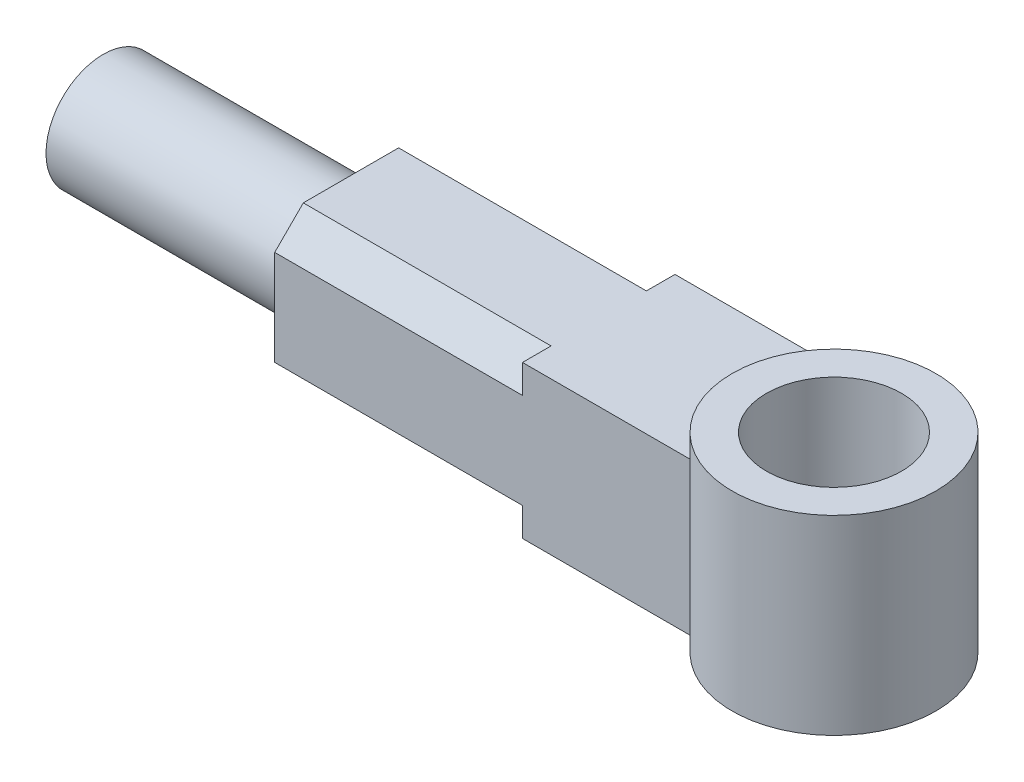
ISO-10303-21;
HEADER;
FILE_DESCRIPTION(('STEP AP214'),'2;1');
FILE_NAME('part.step','',(''),(''),'','','');
FILE_SCHEMA(('AUTOMOTIVE_DESIGN { 1 0 10303 214 1 1 1 1 }'));
ENDSEC;
DATA;
#1=APPLICATION_CONTEXT('core data for automotive mechanical design processes');
#2=APPLICATION_PROTOCOL_DEFINITION('international standard','automotive_design',2000,#1);
#3=PRODUCT_CONTEXT('',#1,'mechanical');
#4=PRODUCT('Part','Part','',(#3));
#5=PRODUCT_RELATED_PRODUCT_CATEGORY('part','',(#4));
#6=PRODUCT_DEFINITION_FORMATION('','',#4);
#7=PRODUCT_DEFINITION_CONTEXT('part definition',#1,'design');
#8=PRODUCT_DEFINITION('design','',#6,#7);
#9=PRODUCT_DEFINITION_SHAPE('','',#8);
#10=(LENGTH_UNIT() NAMED_UNIT(*) SI_UNIT(.MILLI.,.METRE.));
#11=(NAMED_UNIT(*) PLANE_ANGLE_UNIT() SI_UNIT($,.RADIAN.));
#12=(NAMED_UNIT(*) SI_UNIT($,.STERADIAN.) SOLID_ANGLE_UNIT());
#13=UNCERTAINTY_MEASURE_WITH_UNIT(LENGTH_MEASURE(1.E-05),#10,'distance_accuracy_value','');
#14=(GEOMETRIC_REPRESENTATION_CONTEXT(3) GLOBAL_UNCERTAINTY_ASSIGNED_CONTEXT((#13)) GLOBAL_UNIT_ASSIGNED_CONTEXT((#10,
#11,#12)) REPRESENTATION_CONTEXT('',''));
#15=CARTESIAN_POINT('',(0.,0.,0.));
#16=DIRECTION('',(0.,0.,1.));
#17=DIRECTION('',(1.,0.,0.));
#18=AXIS2_PLACEMENT_3D('',#15,#16,#17);
#19=CARTESIAN_POINT('',(-140.311288741493,0.,20.));
#20=DIRECTION('',(1.,0.,0.));
#21=DIRECTION('',(0.,0.,-1.));
#22=AXIS2_PLACEMENT_3D('',#19,#20,#21);
#23=PLANE('',#22);
#24=DIRECTION('',(0.,-1.,0.));
#25=VECTOR('',#24,1.);
#26=CARTESIAN_POINT('',(-140.311288741493,0.,-20.));
#27=LINE('',#26,#25);
#28=CARTESIAN_POINT('',(-140.311288741493,12.5,-20.));
#29=VERTEX_POINT('',#28);
#30=CARTESIAN_POINT('',(-140.311288741493,-12.4999999999998,-20.0000000000002));
#31=VERTEX_POINT('',#30);
#32=EDGE_CURVE('E160',#29,#31,#27,.T.);
#33=ORIENTED_EDGE('',*,*,#32,.T.);
#34=DIRECTION('',(0.,0.707106781186552,-0.707106781186543));
#35=VECTOR('',#34,1.);
#36=CARTESIAN_POINT('',(-140.311288741493,-12.4999999999998,-20.0000000000002));
#37=LINE('',#36,#35);
#38=CARTESIAN_POINT('',(-140.311288741493,-19.9999999999999,-12.5000000000002));
#39=VERTEX_POINT('',#38);
#40=EDGE_CURVE('E178',#39,#31,#37,.T.);
#41=ORIENTED_EDGE('',*,*,#40,.F.);
#42=DIRECTION('',(0.,0.,-1.));
#43=VECTOR('',#42,1.);
#44=CARTESIAN_POINT('',(-140.311288741493,-20.,20.));
#45=LINE('',#44,#43);
#46=CARTESIAN_POINT('',(-140.311288741493,-20.,12.5));
#47=VERTEX_POINT('',#46);
#48=EDGE_CURVE('E170',#47,#39,#45,.T.);
#49=ORIENTED_EDGE('',*,*,#48,.F.);
#50=DIRECTION('',(0.,-0.70710678118655,-0.707106781186545));
#51=VECTOR('',#50,1.);
#52=CARTESIAN_POINT('',(-140.311288741493,-20.,12.5));
#53=LINE('',#52,#51);
#54=CARTESIAN_POINT('',(-140.311288741493,-12.5,20.));
#55=VERTEX_POINT('',#54);
#56=EDGE_CURVE('E192',#55,#47,#53,.T.);
#57=ORIENTED_EDGE('',*,*,#56,.F.);
#58=DIRECTION('',(0.,-1.,0.));
#59=VECTOR('',#58,1.);
#60=CARTESIAN_POINT('',(-140.311288741493,0.,20.));
#61=LINE('',#60,#59);
#62=CARTESIAN_POINT('',(-140.311288741493,12.5,20.));
#63=VERTEX_POINT('',#62);
#64=EDGE_CURVE('E174',#63,#55,#61,.T.);
#65=ORIENTED_EDGE('',*,*,#64,.F.);
#66=DIRECTION('',(0.,-0.707106781186547,0.707106781186548));
#67=VECTOR('',#66,1.);
#68=CARTESIAN_POINT('',(-140.311288741493,12.5,20.));
#69=LINE('',#68,#67);
#70=CARTESIAN_POINT('',(-140.311288741493,20.,12.5));
#71=VERTEX_POINT('',#70);
#72=EDGE_CURVE('E207',#71,#63,#69,.T.);
#73=ORIENTED_EDGE('',*,*,#72,.F.);
#74=DIRECTION('',(0.,0.,-1.));
#75=VECTOR('',#74,1.);
#76=CARTESIAN_POINT('',(-140.311288741493,20.,20.));
#77=LINE('',#76,#75);
#78=CARTESIAN_POINT('',(-140.311288741493,20.,-12.5));
#79=VERTEX_POINT('',#78);
#80=EDGE_CURVE('E173',#71,#79,#77,.T.);
#81=ORIENTED_EDGE('',*,*,#80,.T.);
#82=DIRECTION('',(0.,0.70710678118655,0.707106781186545));
#83=VECTOR('',#82,1.);
#84=CARTESIAN_POINT('',(-140.311288741493,20.,-12.5));
#85=LINE('',#84,#83);
#86=EDGE_CURVE('E225',#29,#79,#85,.T.);
#87=ORIENTED_EDGE('',*,*,#86,.F.);
#88=EDGE_LOOP('',(#33,#41,#49,#57,#65,#73,#81,#87));
#89=FACE_BOUND('',#88,.T.);
#90=CARTESIAN_POINT('',(-140.311288741493,0.,0.));
#91=DIRECTION('',(1.,0.,0.));
#92=DIRECTION('',(0.,0.,-1.));
#93=AXIS2_PLACEMENT_3D('',#90,#91,#92);
#94=CIRCLE('',#93,15.);
#95=CARTESIAN_POINT('',(-140.311288741493,0.,-15.));
#96=VERTEX_POINT('',#95);
#97=EDGE_CURVE('E60',#96,#96,#94,.F.);
#98=ORIENTED_EDGE('',*,*,#97,.F.);
#99=EDGE_LOOP('',(#98));
#100=FACE_BOUND('',#99,.T.);
#101=ADVANCED_FACE('F51',(#89,#100),#23,.F.);
#102=CARTESIAN_POINT('',(0.,-20.,20.));
#103=DIRECTION('',(0.,-1.,0.));
#104=DIRECTION('',(1.,0.,0.));
#105=AXIS2_PLACEMENT_3D('',#102,#103,#104);
#106=PLANE('',#105);
#107=CARTESIAN_POINT('',(-13.5890665192705,-20.,0.));
#108=DIRECTION('',(0.,-1.,0.));
#109=DIRECTION('',(1.,0.,0.));
#110=AXIS2_PLACEMENT_3D('',#107,#108,#109);
#111=CIRCLE('',#110,26.7222222222222);
#112=CARTESIAN_POINT('',(-31.3112887414927,-20.,20.));
#113=VERTEX_POINT('',#112);
#114=CARTESIAN_POINT('',(-31.3112887414927,-20.,-20.));
#115=VERTEX_POINT('',#114);
#116=EDGE_CURVE('E139',#113,#115,#111,.T.);
#117=ORIENTED_EDGE('',*,*,#116,.F.);
#118=DIRECTION('',(-1.,0.,0.));
#119=VECTOR('',#118,1.);
#120=CARTESIAN_POINT('',(0.,-20.,20.));
#121=LINE('',#120,#119);
#122=CARTESIAN_POINT('',(-75.3112887414927,-20.,20.));
#123=VERTEX_POINT('',#122);
#124=EDGE_CURVE('E164',#113,#123,#121,.T.);
#125=ORIENTED_EDGE('',*,*,#124,.T.);
#126=DIRECTION('',(0.,0.,1.));
#127=VECTOR('',#126,1.);
#128=CARTESIAN_POINT('',(-75.3112887414927,-20.,12.5));
#129=LINE('',#128,#127);
#130=CARTESIAN_POINT('',(-75.3112887414927,-20.,12.5));
#131=VERTEX_POINT('',#130);
#132=EDGE_CURVE('E200',#131,#123,#129,.T.);
#133=ORIENTED_EDGE('',*,*,#132,.F.);
#134=DIRECTION('',(-1.,0.,0.));
#135=VECTOR('',#134,1.);
#136=CARTESIAN_POINT('',(-75.3112887414927,-20.,12.5));
#137=LINE('',#136,#135);
#138=EDGE_CURVE('E204',#131,#47,#137,.T.);
#139=ORIENTED_EDGE('',*,*,#138,.T.);
#140=ORIENTED_EDGE('',*,*,#48,.T.);
#141=DIRECTION('',(-1.,0.,0.));
#142=VECTOR('',#141,1.);
#143=CARTESIAN_POINT('',(-75.3112887414927,-19.9999999999999,-12.5000000000002));
#144=LINE('',#143,#142);
#145=CARTESIAN_POINT('',(-75.3112887414927,-19.9999999999999,-12.5000000000002));
#146=VERTEX_POINT('',#145);
#147=EDGE_CURVE('E187',#146,#39,#144,.T.);
#148=ORIENTED_EDGE('',*,*,#147,.F.);
#149=DIRECTION('',(0.,0.,1.));
#150=VECTOR('',#149,1.);
#151=CARTESIAN_POINT('',(-75.3112887414927,-19.9999999999998,-20.0000000000002));
#152=LINE('',#151,#150);
#153=CARTESIAN_POINT('',(-75.3112887414927,-19.9999999999998,-20.0000000000002));
#154=VERTEX_POINT('',#153);
#155=EDGE_CURVE('E179',#154,#146,#152,.T.);
#156=ORIENTED_EDGE('',*,*,#155,.F.);
#157=DIRECTION('',(-1.,0.,0.));
#158=VECTOR('',#157,1.);
#159=CARTESIAN_POINT('',(0.,-20.,-20.));
#160=LINE('',#159,#158);
#161=EDGE_CURVE('E161',#115,#154,#160,.T.);
#162=ORIENTED_EDGE('',*,*,#161,.F.);
#163=EDGE_LOOP('',(#117,#125,#133,#139,#140,#148,#156,#162));
#164=FACE_BOUND('',#163,.T.);
#165=ADVANCED_FACE('F53',(#164),#106,.T.);
#166=CARTESIAN_POINT('',(0.,20.,20.));
#167=DIRECTION('',(0.,-1.,0.));
#168=DIRECTION('',(1.,0.,0.));
#169=AXIS2_PLACEMENT_3D('',#166,#167,#168);
#170=PLANE('',#169);
#171=DIRECTION('',(-1.,0.,0.));
#172=VECTOR('',#171,1.);
#173=CARTESIAN_POINT('',(0.,20.,20.));
#174=LINE('',#173,#172);
#175=CARTESIAN_POINT('',(-31.3112887414927,20.,20.));
#176=VERTEX_POINT('',#175);
#177=CARTESIAN_POINT('',(-75.3112887414927,19.9999999999999,20.));
#178=VERTEX_POINT('',#177);
#179=EDGE_CURVE('E152',#176,#178,#174,.T.);
#180=ORIENTED_EDGE('',*,*,#179,.F.);
#181=CARTESIAN_POINT('',(-13.5890665192705,20.,0.));
#182=DIRECTION('',(0.,-1.,0.));
#183=DIRECTION('',(1.,0.,0.));
#184=AXIS2_PLACEMENT_3D('',#181,#182,#183);
#185=CIRCLE('',#184,26.7222222222222);
#186=CARTESIAN_POINT('',(-31.3112887414927,20.,-20.));
#187=VERTEX_POINT('',#186);
#188=EDGE_CURVE('E136',#176,#187,#185,.T.);
#189=ORIENTED_EDGE('',*,*,#188,.T.);
#190=DIRECTION('',(-1.,0.,0.));
#191=VECTOR('',#190,1.);
#192=CARTESIAN_POINT('',(0.,20.,-20.));
#193=LINE('',#192,#191);
#194=CARTESIAN_POINT('',(-75.3112887414927,20.,-20.));
#195=VERTEX_POINT('',#194);
#196=EDGE_CURVE('E149',#187,#195,#193,.T.);
#197=ORIENTED_EDGE('',*,*,#196,.T.);
#198=DIRECTION('',(0.,0.,-1.));
#199=VECTOR('',#198,1.);
#200=CARTESIAN_POINT('',(-75.3112887414927,20.,-12.5));
#201=LINE('',#200,#199);
#202=CARTESIAN_POINT('',(-75.3112887414927,20.,-12.5));
#203=VERTEX_POINT('',#202);
#204=EDGE_CURVE('E230',#203,#195,#201,.T.);
#205=ORIENTED_EDGE('',*,*,#204,.F.);
#206=DIRECTION('',(-1.,0.,0.));
#207=VECTOR('',#206,1.);
#208=CARTESIAN_POINT('',(-75.3112887414927,20.,-12.5));
#209=LINE('',#208,#207);
#210=EDGE_CURVE('E166',#203,#79,#209,.T.);
#211=ORIENTED_EDGE('',*,*,#210,.T.);
#212=ORIENTED_EDGE('',*,*,#80,.F.);
#213=DIRECTION('',(-1.,0.,0.));
#214=VECTOR('',#213,1.);
#215=CARTESIAN_POINT('',(-75.3112887414927,20.,12.5));
#216=LINE('',#215,#214);
#217=CARTESIAN_POINT('',(-75.3112887414927,20.,12.5));
#218=VERTEX_POINT('',#217);
#219=EDGE_CURVE('E216',#218,#71,#216,.T.);
#220=ORIENTED_EDGE('',*,*,#219,.F.);
#221=DIRECTION('',(0.,0.,-1.));
#222=VECTOR('',#221,1.);
#223=CARTESIAN_POINT('',(-75.3112887414927,19.9999999999999,20.));
#224=LINE('',#223,#222);
#225=EDGE_CURVE('E209',#178,#218,#224,.T.);
#226=ORIENTED_EDGE('',*,*,#225,.F.);
#227=EDGE_LOOP('',(#180,#189,#197,#205,#211,#212,#220,#226));
#228=FACE_BOUND('',#227,.T.);
#229=ADVANCED_FACE('F147',(#228),#170,.F.);
#230=CARTESIAN_POINT('',(0.,0.,20.));
#231=DIRECTION('',(0.,0.,1.));
#232=DIRECTION('',(1.,0.,0.));
#233=AXIS2_PLACEMENT_3D('',#230,#231,#232);
#234=PLANE('',#233);
#235=DIRECTION('',(0.,-1.,0.));
#236=VECTOR('',#235,1.);
#237=CARTESIAN_POINT('',(-31.3112887414927,0.,20.));
#238=LINE('',#237,#236);
#239=EDGE_CURVE('E177',#176,#113,#238,.T.);
#240=ORIENTED_EDGE('',*,*,#239,.F.);
#241=ORIENTED_EDGE('',*,*,#179,.T.);
#242=DIRECTION('',(0.,1.,0.));
#243=VECTOR('',#242,1.);
#244=CARTESIAN_POINT('',(-75.3112887414927,12.5,20.));
#245=LINE('',#244,#243);
#246=CARTESIAN_POINT('',(-75.3112887414927,12.5,20.));
#247=VERTEX_POINT('',#246);
#248=EDGE_CURVE('E214',#247,#178,#245,.T.);
#249=ORIENTED_EDGE('',*,*,#248,.F.);
#250=DIRECTION('',(-1.,0.,0.));
#251=VECTOR('',#250,1.);
#252=CARTESIAN_POINT('',(-75.3112887414927,12.5,20.));
#253=LINE('',#252,#251);
#254=EDGE_CURVE('E218',#247,#63,#253,.T.);
#255=ORIENTED_EDGE('',*,*,#254,.T.);
#256=ORIENTED_EDGE('',*,*,#64,.T.);
#257=DIRECTION('',(-1.,0.,0.));
#258=VECTOR('',#257,1.);
#259=CARTESIAN_POINT('',(-75.3112887414927,-12.5,20.));
#260=LINE('',#259,#258);
#261=CARTESIAN_POINT('',(-75.3112887414927,-12.5,20.));
#262=VERTEX_POINT('',#261);
#263=EDGE_CURVE('E202',#262,#55,#260,.T.);
#264=ORIENTED_EDGE('',*,*,#263,.F.);
#265=DIRECTION('',(0.,1.,0.));
#266=VECTOR('',#265,1.);
#267=CARTESIAN_POINT('',(-75.3112887414927,-20.,20.));
#268=LINE('',#267,#266);
#269=EDGE_CURVE('E194',#123,#262,#268,.T.);
#270=ORIENTED_EDGE('',*,*,#269,.F.);
#271=ORIENTED_EDGE('',*,*,#124,.F.);
#272=EDGE_LOOP('',(#240,#241,#249,#255,#256,#264,#270,#271));
#273=FACE_BOUND('',#272,.T.);
#274=ADVANCED_FACE('F244',(#273),#234,.T.);
#275=CARTESIAN_POINT('',(0.,0.,-20.));
#276=DIRECTION('',(0.,0.,1.));
#277=DIRECTION('',(1.,0.,0.));
#278=AXIS2_PLACEMENT_3D('',#275,#276,#277);
#279=PLANE('',#278);
#280=ORIENTED_EDGE('',*,*,#196,.F.);
#281=DIRECTION('',(0.,-1.,0.));
#282=VECTOR('',#281,1.);
#283=CARTESIAN_POINT('',(-31.3112887414927,0.,-20.));
#284=LINE('',#283,#282);
#285=EDGE_CURVE('E14',#187,#115,#284,.T.);
#286=ORIENTED_EDGE('',*,*,#285,.T.);
#287=ORIENTED_EDGE('',*,*,#161,.T.);
#288=DIRECTION('',(0.,-1.,0.));
#289=VECTOR('',#288,1.);
#290=CARTESIAN_POINT('',(-75.3112887414927,-12.4999999999998,-20.0000000000002));
#291=LINE('',#290,#289);
#292=CARTESIAN_POINT('',(-75.3112887414927,-12.4999999999998,-20.));
#293=VERTEX_POINT('',#292);
#294=EDGE_CURVE('E186',#293,#154,#291,.T.);
#295=ORIENTED_EDGE('',*,*,#294,.F.);
#296=DIRECTION('',(-1.,0.,0.));
#297=VECTOR('',#296,1.);
#298=CARTESIAN_POINT('',(-75.3112887414927,-12.4999999999998,-20.0000000000002));
#299=LINE('',#298,#297);
#300=EDGE_CURVE('E189',#293,#31,#299,.T.);
#301=ORIENTED_EDGE('',*,*,#300,.T.);
#302=ORIENTED_EDGE('',*,*,#32,.F.);
#303=DIRECTION('',(-1.,0.,0.));
#304=VECTOR('',#303,1.);
#305=CARTESIAN_POINT('',(-75.3112887414927,12.5,-20.));
#306=LINE('',#305,#304);
#307=CARTESIAN_POINT('',(-75.3112887414927,12.5,-20.));
#308=VERTEX_POINT('',#307);
#309=EDGE_CURVE('E232',#308,#29,#306,.T.);
#310=ORIENTED_EDGE('',*,*,#309,.F.);
#311=DIRECTION('',(0.,-1.,0.));
#312=VECTOR('',#311,1.);
#313=CARTESIAN_POINT('',(-75.3112887414927,20.,-20.));
#314=LINE('',#313,#312);
#315=EDGE_CURVE('E159',#195,#308,#314,.T.);
#316=ORIENTED_EDGE('',*,*,#315,.F.);
#317=EDGE_LOOP('',(#280,#286,#287,#295,#301,#302,#310,#316));
#318=FACE_BOUND('',#317,.T.);
#319=ADVANCED_FACE('F156',(#318),#279,.F.);
#320=CARTESIAN_POINT('',(-75.3112887414927,20.,-12.5));
#321=DIRECTION('',(0.,-0.707106781186545,0.70710678118655));
#322=DIRECTION('',(0.,-0.70710678118655,-0.707106781186545));
#323=AXIS2_PLACEMENT_3D('',#320,#321,#322);
#324=PLANE('',#323);
#325=ORIENTED_EDGE('',*,*,#86,.T.);
#326=ORIENTED_EDGE('',*,*,#210,.F.);
#327=DIRECTION('',(0.,0.70710678118655,0.707106781186545));
#328=VECTOR('',#327,1.);
#329=CARTESIAN_POINT('',(-75.3112887414927,20.,-12.5));
#330=LINE('',#329,#328);
#331=EDGE_CURVE('E227',#308,#203,#330,.T.);
#332=ORIENTED_EDGE('',*,*,#331,.F.);
#333=ORIENTED_EDGE('',*,*,#309,.T.);
#334=EDGE_LOOP('',(#325,#326,#332,#333));
#335=FACE_BOUND('',#334,.T.);
#336=ADVANCED_FACE('F293',(#335),#324,.F.);
#337=CARTESIAN_POINT('',(-75.3112887414927,0.,0.));
#338=DIRECTION('',(1.,0.,0.));
#339=DIRECTION('',(0.,0.,-1.));
#340=AXIS2_PLACEMENT_3D('',#337,#338,#339);
#341=PLANE('',#340);
#342=ORIENTED_EDGE('',*,*,#315,.T.);
#343=ORIENTED_EDGE('',*,*,#331,.T.);
#344=ORIENTED_EDGE('',*,*,#204,.T.);
#345=EDGE_LOOP('',(#342,#343,#344));
#346=FACE_BOUND('',#345,.T.);
#347=ADVANCED_FACE('F297',(#346),#341,.F.);
#348=CARTESIAN_POINT('',(-205.311288741493,0.,0.));
#349=DIRECTION('',(1.,0.,0.));
#350=DIRECTION('',(0.,0.,-1.));
#351=AXIS2_PLACEMENT_3D('',#348,#349,#350);
#352=CYLINDRICAL_SURFACE('',#351,15.);
#353=CARTESIAN_POINT('',(-205.311288741493,0.,0.));
#354=DIRECTION('',(-1.,0.,0.));
#355=DIRECTION('',(0.,0.,1.));
#356=AXIS2_PLACEMENT_3D('',#353,#354,#355);
#357=CIRCLE('',#356,15.);
#358=CARTESIAN_POINT('',(-205.311288741493,0.,15.));
#359=VERTEX_POINT('',#358);
#360=EDGE_CURVE('E221',#359,#359,#357,.T.);
#361=ORIENTED_EDGE('',*,*,#360,.F.);
#362=EDGE_LOOP('',(#361));
#363=FACE_BOUND('',#362,.T.);
#364=ORIENTED_EDGE('',*,*,#97,.T.);
#365=EDGE_LOOP('',(#364));
#366=FACE_BOUND('',#365,.T.);
#367=ADVANCED_FACE('F276',(#363,#366),#352,.T.);
#368=CARTESIAN_POINT('',(-205.311288741493,0.,0.));
#369=DIRECTION('',(-1.,0.,0.));
#370=DIRECTION('',(0.,0.,1.));
#371=AXIS2_PLACEMENT_3D('',#368,#369,#370);
#372=PLANE('',#371);
#373=ORIENTED_EDGE('',*,*,#360,.T.);
#374=EDGE_LOOP('',(#373));
#375=FACE_BOUND('',#374,.T.);
#376=ADVANCED_FACE('F269',(#375),#372,.T.);
#377=CARTESIAN_POINT('',(-75.3112887414927,12.5,20.));
#378=DIRECTION('',(0.,-0.707106781186548,-0.707106781186547));
#379=DIRECTION('',(0.,0.707106781186547,-0.707106781186548));
#380=AXIS2_PLACEMENT_3D('',#377,#378,#379);
#381=PLANE('',#380);
#382=ORIENTED_EDGE('',*,*,#72,.T.);
#383=ORIENTED_EDGE('',*,*,#254,.F.);
#384=DIRECTION('',(0.,-0.707106781186547,0.707106781186548));
#385=VECTOR('',#384,1.);
#386=CARTESIAN_POINT('',(-75.3112887414927,12.5,20.));
#387=LINE('',#386,#385);
#388=EDGE_CURVE('E212',#218,#247,#387,.T.);
#389=ORIENTED_EDGE('',*,*,#388,.F.);
#390=ORIENTED_EDGE('',*,*,#219,.T.);
#391=EDGE_LOOP('',(#382,#383,#389,#390));
#392=FACE_BOUND('',#391,.T.);
#393=ADVANCED_FACE('F267',(#392),#381,.F.);
#394=CARTESIAN_POINT('',(-75.3112887414927,0.,0.));
#395=DIRECTION('',(1.,0.,0.));
#396=DIRECTION('',(0.,1.,0.));
#397=AXIS2_PLACEMENT_3D('',#394,#395,#396);
#398=PLANE('',#397);
#399=ORIENTED_EDGE('',*,*,#225,.T.);
#400=ORIENTED_EDGE('',*,*,#388,.T.);
#401=ORIENTED_EDGE('',*,*,#248,.T.);
#402=EDGE_LOOP('',(#399,#400,#401));
#403=FACE_BOUND('',#402,.T.);
#404=ADVANCED_FACE('F264',(#403),#398,.F.);
#405=CARTESIAN_POINT('',(-75.3112887414927,-20.,12.5));
#406=DIRECTION('',(0.,0.707106781186545,-0.70710678118655));
#407=DIRECTION('',(0.,0.70710678118655,0.707106781186545));
#408=AXIS2_PLACEMENT_3D('',#405,#406,#407);
#409=PLANE('',#408);
#410=ORIENTED_EDGE('',*,*,#56,.T.);
#411=ORIENTED_EDGE('',*,*,#138,.F.);
#412=DIRECTION('',(0.,-0.70710678118655,-0.707106781186545));
#413=VECTOR('',#412,1.);
#414=CARTESIAN_POINT('',(-75.3112887414927,-20.,12.5));
#415=LINE('',#414,#413);
#416=EDGE_CURVE('E197',#262,#131,#415,.T.);
#417=ORIENTED_EDGE('',*,*,#416,.F.);
#418=ORIENTED_EDGE('',*,*,#263,.T.);
#419=EDGE_LOOP('',(#410,#411,#417,#418));
#420=FACE_BOUND('',#419,.T.);
#421=ADVANCED_FACE('F256',(#420),#409,.F.);
#422=CARTESIAN_POINT('',(-75.3112887414927,0.,0.));
#423=DIRECTION('',(1.,0.,0.));
#424=DIRECTION('',(0.,0.,1.));
#425=AXIS2_PLACEMENT_3D('',#422,#423,#424);
#426=PLANE('',#425);
#427=ORIENTED_EDGE('',*,*,#269,.T.);
#428=ORIENTED_EDGE('',*,*,#416,.T.);
#429=ORIENTED_EDGE('',*,*,#132,.T.);
#430=EDGE_LOOP('',(#427,#428,#429));
#431=FACE_BOUND('',#430,.T.);
#432=ADVANCED_FACE('F262',(#431),#426,.F.);
#433=CARTESIAN_POINT('',(-75.3112887414927,-12.4999999999998,-20.0000000000002));
#434=DIRECTION('',(0.,0.707106781186543,0.707106781186552));
#435=DIRECTION('',(0.,-0.707106781186552,0.707106781186543));
#436=AXIS2_PLACEMENT_3D('',#433,#434,#435);
#437=PLANE('',#436);
#438=ORIENTED_EDGE('',*,*,#40,.T.);
#439=ORIENTED_EDGE('',*,*,#300,.F.);
#440=DIRECTION('',(0.,0.707106781186552,-0.707106781186543));
#441=VECTOR('',#440,1.);
#442=CARTESIAN_POINT('',(-75.3112887414927,-12.4999999999998,-20.0000000000002));
#443=LINE('',#442,#441);
#444=EDGE_CURVE('E67',#146,#293,#443,.T.);
#445=ORIENTED_EDGE('',*,*,#444,.F.);
#446=ORIENTED_EDGE('',*,*,#147,.T.);
#447=EDGE_LOOP('',(#438,#439,#445,#446));
#448=FACE_BOUND('',#447,.T.);
#449=ADVANCED_FACE('F342',(#448),#437,.F.);
#450=CARTESIAN_POINT('',(-75.3112887414927,0.,0.));
#451=DIRECTION('',(1.,0.,0.));
#452=DIRECTION('',(0.,-1.,0.));
#453=AXIS2_PLACEMENT_3D('',#450,#451,#452);
#454=PLANE('',#453);
#455=ORIENTED_EDGE('',*,*,#155,.T.);
#456=ORIENTED_EDGE('',*,*,#444,.T.);
#457=ORIENTED_EDGE('',*,*,#294,.T.);
#458=EDGE_LOOP('',(#455,#456,#457));
#459=FACE_BOUND('',#458,.T.);
#460=ADVANCED_FACE('F351',(#459),#454,.F.);
#461=CARTESIAN_POINT('',(-13.5890665192705,-25.,0.));
#462=DIRECTION('',(0.,1.,0.));
#463=DIRECTION('',(-1.,0.,0.));
#464=AXIS2_PLACEMENT_3D('',#461,#462,#463);
#465=CYLINDRICAL_SURFACE('',#464,26.7222222222222);
#466=CARTESIAN_POINT('',(-13.5890665192705,25.,0.));
#467=DIRECTION('',(0.,1.,0.));
#468=DIRECTION('',(-1.,0.,0.));
#469=AXIS2_PLACEMENT_3D('',#466,#467,#468);
#470=CIRCLE('',#469,26.7222222222222);
#471=CARTESIAN_POINT('',(-40.3112887414927,25.,0.));
#472=VERTEX_POINT('',#471);
#473=EDGE_CURVE('E406',#472,#472,#470,.T.);
#474=ORIENTED_EDGE('',*,*,#473,.F.);
#475=EDGE_LOOP('',(#474));
#476=FACE_BOUND('',#475,.T.);
#477=CARTESIAN_POINT('',(-13.5890665192705,-25.,0.));
#478=DIRECTION('',(0.,1.,0.));
#479=DIRECTION('',(-1.,0.,0.));
#480=AXIS2_PLACEMENT_3D('',#477,#478,#479);
#481=CIRCLE('',#480,26.7222222222222);
#482=CARTESIAN_POINT('',(-40.3112887414927,-25.,0.));
#483=VERTEX_POINT('',#482);
#484=EDGE_CURVE('E153',#483,#483,#481,.T.);
#485=ORIENTED_EDGE('',*,*,#484,.T.);
#486=EDGE_LOOP('',(#485));
#487=FACE_BOUND('',#486,.T.);
#488=ORIENTED_EDGE('',*,*,#239,.T.);
#489=ORIENTED_EDGE('',*,*,#116,.T.);
#490=ORIENTED_EDGE('',*,*,#285,.F.);
#491=ORIENTED_EDGE('',*,*,#188,.F.);
#492=EDGE_LOOP('',(#488,#489,#490,#491));
#493=FACE_BOUND('',#492,.T.);
#494=ADVANCED_FACE('F135',(#476,#487,#493),#465,.T.);
#495=CARTESIAN_POINT('',(-13.5890665192705,-25.,0.));
#496=DIRECTION('',(0.,1.,0.));
#497=DIRECTION('',(-1.,0.,0.));
#498=AXIS2_PLACEMENT_3D('',#495,#496,#497);
#499=PLANE('',#498);
#500=CARTESIAN_POINT('',(-13.5890665192705,-25.,0.));
#501=DIRECTION('',(0.,1.,0.));
#502=DIRECTION('',(-1.,0.,0.));
#503=AXIS2_PLACEMENT_3D('',#500,#501,#502);
#504=CIRCLE('',#503,17.7222222222222);
#505=CARTESIAN_POINT('',(-31.3112887414927,-25.,0.));
#506=VERTEX_POINT('',#505);
#507=EDGE_CURVE('E412',#506,#506,#504,.T.);
#508=ORIENTED_EDGE('',*,*,#507,.T.);
#509=EDGE_LOOP('',(#508));
#510=FACE_BOUND('',#509,.T.);
#511=ORIENTED_EDGE('',*,*,#484,.F.);
#512=EDGE_LOOP('',(#511));
#513=FACE_BOUND('',#512,.T.);
#514=ADVANCED_FACE('F369',(#510,#513),#499,.F.);
#515=CARTESIAN_POINT('',(-13.5890665192705,-25.,0.));
#516=DIRECTION('',(0.,1.,0.));
#517=DIRECTION('',(-1.,0.,0.));
#518=AXIS2_PLACEMENT_3D('',#515,#516,#517);
#519=CYLINDRICAL_SURFACE('',#518,17.7222222222222);
#520=CARTESIAN_POINT('',(-13.5890665192705,25.,0.));
#521=DIRECTION('',(0.,1.,0.));
#522=DIRECTION('',(-1.,0.,0.));
#523=AXIS2_PLACEMENT_3D('',#520,#521,#522);
#524=CIRCLE('',#523,17.7222222222222);
#525=CARTESIAN_POINT('',(-31.3112887414927,25.,0.));
#526=VERTEX_POINT('',#525);
#527=EDGE_CURVE('E409',#526,#526,#524,.T.);
#528=CARTESIAN_POINT('',(-31.3112887414927,-25.,0.));
#529=CARTESIAN_POINT('',(-31.3112887414927,-24.4791666666666,0.));
#530=CARTESIAN_POINT('',(-31.3112887414927,-23.9583333333333,0.));
#531=CARTESIAN_POINT('',(-31.3112887414927,-22.9166666666666,0.));
#532=CARTESIAN_POINT('',(-31.3112887414927,-22.3958333333333,0.));
#533=CARTESIAN_POINT('',(-31.3112887414927,-21.3541666666666,0.));
#534=CARTESIAN_POINT('',(-31.3112887414927,-20.8333333333333,0.));
#535=CARTESIAN_POINT('',(-31.3112887414927,-19.7916666666666,0.));
#536=CARTESIAN_POINT('',(-31.3112887414927,-19.2708333333333,0.));
#537=CARTESIAN_POINT('',(-31.3112887414927,-18.2291666666666,0.));
#538=CARTESIAN_POINT('',(-31.3112887414927,-17.7083333333333,0.));
#539=CARTESIAN_POINT('',(-31.3112887414927,-16.6666666666666,0.));
#540=CARTESIAN_POINT('',(-31.3112887414927,-16.1458333333333,0.));
#541=CARTESIAN_POINT('',(-31.3112887414927,-15.1041666666666,0.));
#542=CARTESIAN_POINT('',(-31.3112887414927,-14.5833333333333,0.));
#543=CARTESIAN_POINT('',(-31.3112887414927,-13.5416666666666,0.));
#544=CARTESIAN_POINT('',(-31.3112887414927,-13.0208333333333,0.));
#545=CARTESIAN_POINT('',(-31.3112887414927,-11.9791666666666,0.));
#546=CARTESIAN_POINT('',(-31.3112887414927,-11.4583333333333,0.));
#547=CARTESIAN_POINT('',(-31.3112887414927,-10.4166666666666,0.));
#548=CARTESIAN_POINT('',(-31.3112887414927,-9.89583333333331,0.));
#549=CARTESIAN_POINT('',(-31.3112887414927,-8.85416666666664,0.));
#550=CARTESIAN_POINT('',(-31.3112887414927,-8.33333333333331,0.));
#551=CARTESIAN_POINT('',(-31.3112887414927,-7.29166666666665,0.));
#552=CARTESIAN_POINT('',(-31.3112887414927,-6.77083333333332,0.));
#553=CARTESIAN_POINT('',(-31.3112887414927,-5.72916666666665,0.));
#554=CARTESIAN_POINT('',(-31.3112887414927,-5.20833333333331,0.));
#555=CARTESIAN_POINT('',(-31.3112887414927,-4.16666666666665,0.));
#556=CARTESIAN_POINT('',(-31.3112887414927,-3.64583333333331,0.));
#557=CARTESIAN_POINT('',(-31.3112887414927,-2.60416666666665,0.));
#558=CARTESIAN_POINT('',(-31.3112887414927,-2.08333333333332,0.));
#559=CARTESIAN_POINT('',(-31.3112887414927,-1.04166666666665,0.));
#560=CARTESIAN_POINT('',(-31.3112887414927,-0.520833333333316,0.));
#561=CARTESIAN_POINT('',(-31.3112887414927,0.520833333333351,0.));
#562=CARTESIAN_POINT('',(-31.3112887414927,1.04166666666669,0.));
#563=CARTESIAN_POINT('',(-31.3112887414927,2.08333333333335,0.));
#564=CARTESIAN_POINT('',(-31.3112887414927,2.60416666666668,0.));
#565=CARTESIAN_POINT('',(-31.3112887414927,3.64583333333335,0.));
#566=CARTESIAN_POINT('',(-31.3112887414927,4.16666666666668,0.));
#567=CARTESIAN_POINT('',(-31.3112887414927,5.20833333333335,0.));
#568=CARTESIAN_POINT('',(-31.3112887414927,5.72916666666668,0.));
#569=CARTESIAN_POINT('',(-31.3112887414927,6.77083333333335,0.));
#570=CARTESIAN_POINT('',(-31.3112887414927,7.29166666666668,0.));
#571=CARTESIAN_POINT('',(-31.3112887414927,8.33333333333335,0.));
#572=CARTESIAN_POINT('',(-31.3112887414927,8.85416666666668,0.));
#573=CARTESIAN_POINT('',(-31.3112887414927,9.89583333333334,0.));
#574=CARTESIAN_POINT('',(-31.3112887414927,10.4166666666667,0.));
#575=CARTESIAN_POINT('',(-31.3112887414927,11.4583333333333,0.));
#576=CARTESIAN_POINT('',(-31.3112887414927,11.9791666666667,0.));
#577=CARTESIAN_POINT('',(-31.3112887414927,13.0208333333333,0.));
#578=CARTESIAN_POINT('',(-31.3112887414927,13.5416666666667,0.));
#579=CARTESIAN_POINT('',(-31.3112887414927,14.5833333333333,0.));
#580=CARTESIAN_POINT('',(-31.3112887414927,15.1041666666667,0.));
#581=CARTESIAN_POINT('',(-31.3112887414927,16.1458333333333,0.));
#582=CARTESIAN_POINT('',(-31.3112887414927,16.6666666666667,0.));
#583=CARTESIAN_POINT('',(-31.3112887414927,17.7083333333333,0.));
#584=CARTESIAN_POINT('',(-31.3112887414927,18.2291666666667,0.));
#585=CARTESIAN_POINT('',(-31.3112887414927,19.2708333333333,0.));
#586=CARTESIAN_POINT('',(-31.3112887414927,19.7916666666667,0.));
#587=CARTESIAN_POINT('',(-31.3112887414927,20.8333333333333,0.));
#588=CARTESIAN_POINT('',(-31.3112887414927,21.3541666666667,0.));
#589=CARTESIAN_POINT('',(-31.3112887414927,22.3958333333333,0.));
#590=CARTESIAN_POINT('',(-31.3112887414927,22.9166666666667,0.));
#591=CARTESIAN_POINT('',(-31.3112887414927,23.9583333333333,0.));
#592=CARTESIAN_POINT('',(-31.3112887414927,24.4791666666667,0.));
#593=CARTESIAN_POINT('',(-31.3112887414927,25.,0.));
#594=B_SPLINE_CURVE_WITH_KNOTS('',3,(#528,#529,#530,#531,#532,#533,#534,#535,#536,#537,#538,
#539,#540,#541,#542,#543,#544,#545,#546,#547,#548,#549,#550,#551,#552,#553,#554,#555,#556,#557,
#558,#559,#560,#561,#562,#563,#564,#565,#566,#567,#568,#569,#570,#571,#572,#573,#574,#575,#576,
#577,#578,#579,#580,#581,#582,#583,#584,#585,#586,#587,#588,#589,#590,#591,#592,#593),
.UNSPECIFIED.,.F.,.F.,(4,2,2,2,2,2,2,2,2,2,2,2,2,2,2,2,2,2,2,2,2,2,2,2,2,2,2,2,2,2,2,2,4),(0.,
1.5625,3.125,4.6875,6.25,7.8125,9.375,10.9375,12.5,14.0625,15.625,17.1875,18.75,20.3125,21.875,
23.4375,25.,26.5625,28.125,29.6875,31.25,32.8125,34.375,35.9375,37.5,39.0625,40.625,42.1875,
43.75,45.3125,46.875,48.4375,50.),.UNSPECIFIED.);
#595=EDGE_CURVE('BSEAM379',#506,#526,#594,.T.);
#596=ORIENTED_EDGE('',*,*,#507,.F.);
#597=ORIENTED_EDGE('',*,*,#527,.T.);
#598=ORIENTED_EDGE('',*,*,#595,.T.);
#599=ORIENTED_EDGE('',*,*,#595,.F.);
#600=EDGE_LOOP('',(#596,#598,#597,#599));
#601=FACE_BOUND('',#600,.T.);
#602=ADVANCED_FACE('F379',(#601),#519,.F.);
#603=CARTESIAN_POINT('',(-13.5890665192705,25.,0.));
#604=DIRECTION('',(0.,1.,0.));
#605=DIRECTION('',(-1.,0.,0.));
#606=AXIS2_PLACEMENT_3D('',#603,#604,#605);
#607=PLANE('',#606);
#608=ORIENTED_EDGE('',*,*,#473,.T.);
#609=EDGE_LOOP('',(#608));
#610=FACE_BOUND('',#609,.T.);
#611=ORIENTED_EDGE('',*,*,#527,.F.);
#612=EDGE_LOOP('',(#611));
#613=FACE_BOUND('',#612,.T.);
#614=ADVANCED_FACE('F389',(#610,#613),#607,.T.);
#615=CLOSED_SHELL('',(#101,#165,#229,#274,#319,#336,#347,#367,#376,#393,#404,#421,#432,#449,
#460,#494,#514,#602,#614));
#616=MANIFOLD_SOLID_BREP('B2',#615);
#617=ADVANCED_BREP_SHAPE_REPRESENTATION('',(#18,#616),#14);
#618=SHAPE_DEFINITION_REPRESENTATION(#9,#617);
ENDSEC;
END-ISO-10303-21;
